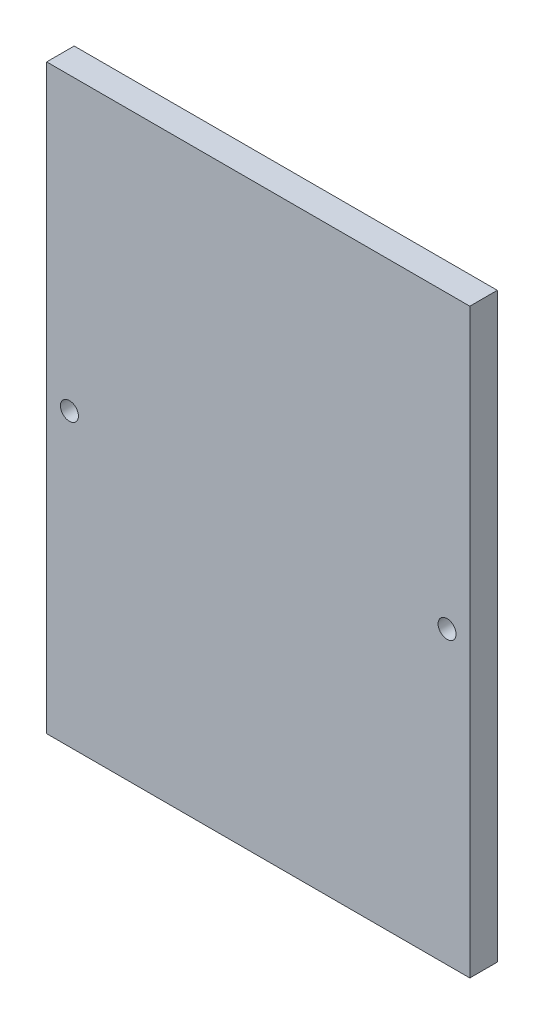
ISO-10303-21;
HEADER;
FILE_DESCRIPTION(('STEP AP214'),'2;1');
FILE_NAME('part.step','',(''),(''),'','','');
FILE_SCHEMA(('AUTOMOTIVE_DESIGN { 1 0 10303 214 1 1 1 1 }'));
ENDSEC;
DATA;
#1=APPLICATION_CONTEXT('core data for automotive mechanical design processes');
#2=APPLICATION_PROTOCOL_DEFINITION('international standard','automotive_design',2000,#1);
#3=PRODUCT_CONTEXT('',#1,'mechanical');
#4=PRODUCT('Part','Part','',(#3));
#5=PRODUCT_RELATED_PRODUCT_CATEGORY('part','',(#4));
#6=PRODUCT_DEFINITION_FORMATION('','',#4);
#7=PRODUCT_DEFINITION_CONTEXT('part definition',#1,'design');
#8=PRODUCT_DEFINITION('design','',#6,#7);
#9=PRODUCT_DEFINITION_SHAPE('','',#8);
#10=(LENGTH_UNIT() NAMED_UNIT(*) SI_UNIT(.MILLI.,.METRE.));
#11=(NAMED_UNIT(*) PLANE_ANGLE_UNIT() SI_UNIT($,.RADIAN.));
#12=(NAMED_UNIT(*) SI_UNIT($,.STERADIAN.) SOLID_ANGLE_UNIT());
#13=UNCERTAINTY_MEASURE_WITH_UNIT(LENGTH_MEASURE(1.E-05),#10,'distance_accuracy_value','');
#14=(GEOMETRIC_REPRESENTATION_CONTEXT(3) GLOBAL_UNCERTAINTY_ASSIGNED_CONTEXT((#13)) GLOBAL_UNIT_ASSIGNED_CONTEXT((#10,
#11,#12)) REPRESENTATION_CONTEXT('',''));
#15=CARTESIAN_POINT('',(0.,0.,0.));
#16=DIRECTION('',(0.,0.,1.));
#17=DIRECTION('',(1.,0.,0.));
#18=AXIS2_PLACEMENT_3D('',#15,#16,#17);
#19=CARTESIAN_POINT('',(-94.5483425414365,65.5084944751381,3.302));
#20=DIRECTION('',(1.,0.,0.));
#21=DIRECTION('',(0.,0.,-1.));
#22=AXIS2_PLACEMENT_3D('',#19,#20,#21);
#23=PLANE('',#22);
#24=DIRECTION('',(0.,-1.,0.));
#25=VECTOR('',#24,1.);
#26=CARTESIAN_POINT('',(-94.5483425414365,65.5084944751381,0.));
#27=LINE('',#26,#25);
#28=CARTESIAN_POINT('',(-94.5483425414365,65.5084944751381,0.));
#29=VERTEX_POINT('',#28);
#30=CARTESIAN_POINT('',(-94.5483425414365,-4.34150552486188,0.));
#31=VERTEX_POINT('',#30);
#32=EDGE_CURVE('E96',#29,#31,#27,.T.);
#33=ORIENTED_EDGE('',*,*,#32,.T.);
#34=DIRECTION('',(0.,0.,-1.));
#35=VECTOR('',#34,1.);
#36=CARTESIAN_POINT('',(-94.5483425414365,-4.34150552486188,3.302));
#37=LINE('',#36,#35);
#38=CARTESIAN_POINT('',(-94.5483425414365,-4.34150552486188,3.302));
#39=VERTEX_POINT('',#38);
#40=EDGE_CURVE('E11',#39,#31,#37,.T.);
#41=ORIENTED_EDGE('',*,*,#40,.F.);
#42=DIRECTION('',(0.,-1.,0.));
#43=VECTOR('',#42,1.);
#44=CARTESIAN_POINT('',(-94.5483425414365,65.5084944751381,3.302));
#45=LINE('',#44,#43);
#46=CARTESIAN_POINT('',(-94.5483425414365,65.5084944751381,3.302));
#47=VERTEX_POINT('',#46);
#48=EDGE_CURVE('E82',#47,#39,#45,.T.);
#49=ORIENTED_EDGE('',*,*,#48,.F.);
#50=DIRECTION('',(0.,0.,-1.));
#51=VECTOR('',#50,1.);
#52=CARTESIAN_POINT('',(-94.5483425414365,65.5084944751381,3.302));
#53=LINE('',#52,#51);
#54=EDGE_CURVE('E49',#47,#29,#53,.T.);
#55=ORIENTED_EDGE('',*,*,#54,.T.);
#56=EDGE_LOOP('',(#33,#41,#49,#55));
#57=FACE_BOUND('',#56,.T.);
#58=ADVANCED_FACE('F33',(#57),#23,.F.);
#59=CARTESIAN_POINT('',(-94.5483425414365,-4.34150552486188,3.302));
#60=DIRECTION('',(0.,1.,0.));
#61=DIRECTION('',(0.,0.,1.));
#62=AXIS2_PLACEMENT_3D('',#59,#60,#61);
#63=PLANE('',#62);
#64=DIRECTION('',(1.,0.,0.));
#65=VECTOR('',#64,1.);
#66=CARTESIAN_POINT('',(-94.5483425414365,-4.34150552486188,0.));
#67=LINE('',#66,#65);
#68=CARTESIAN_POINT('',(-43.7483425414365,-4.34150552486188,0.));
#69=VERTEX_POINT('',#68);
#70=EDGE_CURVE('E87',#31,#69,#67,.T.);
#71=ORIENTED_EDGE('',*,*,#70,.T.);
#72=DIRECTION('',(0.,0.,-1.));
#73=VECTOR('',#72,1.);
#74=CARTESIAN_POINT('',(-43.7483425414365,-4.34150552486188,3.302));
#75=LINE('',#74,#73);
#76=CARTESIAN_POINT('',(-43.7483425414365,-4.34150552486188,3.302));
#77=VERTEX_POINT('',#76);
#78=EDGE_CURVE('E41',#77,#69,#75,.T.);
#79=ORIENTED_EDGE('',*,*,#78,.F.);
#80=DIRECTION('',(1.,0.,0.));
#81=VECTOR('',#80,1.);
#82=CARTESIAN_POINT('',(-94.5483425414365,-4.34150552486188,3.302));
#83=LINE('',#82,#81);
#84=EDGE_CURVE('E74',#39,#77,#83,.T.);
#85=ORIENTED_EDGE('',*,*,#84,.F.);
#86=ORIENTED_EDGE('',*,*,#40,.T.);
#87=EDGE_LOOP('',(#71,#79,#85,#86));
#88=FACE_BOUND('',#87,.T.);
#89=ADVANCED_FACE('F86',(#88),#63,.F.);
#90=CARTESIAN_POINT('',(-43.7483425414365,65.5084944751381,3.302));
#91=DIRECTION('',(1.,0.,0.));
#92=DIRECTION('',(0.,1.,0.));
#93=AXIS2_PLACEMENT_3D('',#90,#91,#92);
#94=PLANE('',#93);
#95=DIRECTION('',(0.,-1.,0.));
#96=VECTOR('',#95,1.);
#97=CARTESIAN_POINT('',(-43.7483425414365,65.5084944751381,0.));
#98=LINE('',#97,#96);
#99=CARTESIAN_POINT('',(-43.7483425414365,65.5084944751381,0.));
#100=VERTEX_POINT('',#99);
#101=EDGE_CURVE('E100',#100,#69,#98,.T.);
#102=ORIENTED_EDGE('',*,*,#101,.F.);
#103=DIRECTION('',(0.,0.,-1.));
#104=VECTOR('',#103,1.);
#105=CARTESIAN_POINT('',(-43.7483425414365,65.5084944751381,3.302));
#106=LINE('',#105,#104);
#107=CARTESIAN_POINT('',(-43.7483425414365,65.5084944751381,3.302));
#108=VERTEX_POINT('',#107);
#109=EDGE_CURVE('E63',#108,#100,#106,.T.);
#110=ORIENTED_EDGE('',*,*,#109,.F.);
#111=DIRECTION('',(0.,-1.,0.));
#112=VECTOR('',#111,1.);
#113=CARTESIAN_POINT('',(-43.7483425414365,65.5084944751381,3.302));
#114=LINE('',#113,#112);
#115=EDGE_CURVE('E81',#108,#77,#114,.T.);
#116=ORIENTED_EDGE('',*,*,#115,.T.);
#117=ORIENTED_EDGE('',*,*,#78,.T.);
#118=EDGE_LOOP('',(#102,#110,#116,#117));
#119=FACE_BOUND('',#118,.T.);
#120=ADVANCED_FACE('F90',(#119),#94,.T.);
#121=CARTESIAN_POINT('',(-94.5483425414365,65.5084944751381,3.302));
#122=DIRECTION('',(0.,1.,0.));
#123=DIRECTION('',(-1.,0.,0.));
#124=AXIS2_PLACEMENT_3D('',#121,#122,#123);
#125=PLANE('',#124);
#126=DIRECTION('',(1.,0.,0.));
#127=VECTOR('',#126,1.);
#128=CARTESIAN_POINT('',(-94.5483425414365,65.5084944751381,0.));
#129=LINE('',#128,#127);
#130=EDGE_CURVE('E102',#29,#100,#129,.T.);
#131=ORIENTED_EDGE('',*,*,#130,.F.);
#132=ORIENTED_EDGE('',*,*,#54,.F.);
#133=DIRECTION('',(1.,0.,0.));
#134=VECTOR('',#133,1.);
#135=CARTESIAN_POINT('',(-94.5483425414365,65.5084944751381,3.302));
#136=LINE('',#135,#134);
#137=EDGE_CURVE('E91',#47,#108,#136,.T.);
#138=ORIENTED_EDGE('',*,*,#137,.T.);
#139=ORIENTED_EDGE('',*,*,#109,.T.);
#140=EDGE_LOOP('',(#131,#132,#138,#139));
#141=FACE_BOUND('',#140,.T.);
#142=ADVANCED_FACE('F132',(#141),#125,.T.);
#143=CARTESIAN_POINT('',(0.,0.,3.302));
#144=DIRECTION('',(0.,0.,1.));
#145=DIRECTION('',(1.,0.,0.));
#146=AXIS2_PLACEMENT_3D('',#143,#144,#145);
#147=PLANE('',#146);
#148=CARTESIAN_POINT('',(-91.8178425414365,30.5834944751381,3.302));
#149=DIRECTION('',(0.,0.,1.));
#150=DIRECTION('',(1.,0.,0.));
#151=AXIS2_PLACEMENT_3D('',#148,#149,#150);
#152=CIRCLE('',#151,1.0795);
#153=CARTESIAN_POINT('',(-90.7383425414365,30.5834944751381,3.302));
#154=VERTEX_POINT('',#153);
#155=EDGE_CURVE('E114',#154,#154,#152,.T.);
#156=ORIENTED_EDGE('',*,*,#155,.F.);
#157=EDGE_LOOP('',(#156));
#158=FACE_BOUND('',#157,.T.);
#159=CARTESIAN_POINT('',(-46.4788425414364,30.5834944751381,3.302));
#160=DIRECTION('',(0.,0.,1.));
#161=DIRECTION('',(1.,0.,0.));
#162=AXIS2_PLACEMENT_3D('',#159,#160,#161);
#163=CIRCLE('',#162,1.0795);
#164=CARTESIAN_POINT('',(-45.3993425414365,30.5834944751381,3.302));
#165=VERTEX_POINT('',#164);
#166=EDGE_CURVE('E108',#165,#165,#163,.T.);
#167=ORIENTED_EDGE('',*,*,#166,.F.);
#168=EDGE_LOOP('',(#167));
#169=FACE_BOUND('',#168,.T.);
#170=ORIENTED_EDGE('',*,*,#48,.T.);
#171=ORIENTED_EDGE('',*,*,#84,.T.);
#172=ORIENTED_EDGE('',*,*,#115,.F.);
#173=ORIENTED_EDGE('',*,*,#137,.F.);
#174=EDGE_LOOP('',(#170,#171,#172,#173));
#175=FACE_BOUND('',#174,.T.);
#176=ADVANCED_FACE('F78',(#158,#169,#175),#147,.T.);
#177=CARTESIAN_POINT('',(0.,0.,0.));
#178=DIRECTION('',(0.,0.,1.));
#179=DIRECTION('',(1.,0.,0.));
#180=AXIS2_PLACEMENT_3D('',#177,#178,#179);
#181=PLANE('',#180);
#182=CARTESIAN_POINT('',(-91.8178425414365,30.5834944751381,0.));
#183=DIRECTION('',(0.,0.,1.));
#184=DIRECTION('',(1.,0.,0.));
#185=AXIS2_PLACEMENT_3D('',#182,#183,#184);
#186=CIRCLE('',#185,1.0795);
#187=CARTESIAN_POINT('',(-90.7383425414365,30.5834944751381,0.));
#188=VERTEX_POINT('',#187);
#189=EDGE_CURVE('E111',#188,#188,#186,.T.);
#190=ORIENTED_EDGE('',*,*,#189,.T.);
#191=EDGE_LOOP('',(#190));
#192=FACE_BOUND('',#191,.T.);
#193=CARTESIAN_POINT('',(-46.4788425414364,30.5834944751381,0.));
#194=DIRECTION('',(0.,0.,1.));
#195=DIRECTION('',(1.,0.,0.));
#196=AXIS2_PLACEMENT_3D('',#193,#194,#195);
#197=CIRCLE('',#196,1.0795);
#198=CARTESIAN_POINT('',(-45.3993425414365,30.5834944751381,0.));
#199=VERTEX_POINT('',#198);
#200=EDGE_CURVE('E98',#199,#199,#197,.T.);
#201=ORIENTED_EDGE('',*,*,#200,.T.);
#202=EDGE_LOOP('',(#201));
#203=FACE_BOUND('',#202,.T.);
#204=ORIENTED_EDGE('',*,*,#32,.F.);
#205=ORIENTED_EDGE('',*,*,#130,.T.);
#206=ORIENTED_EDGE('',*,*,#101,.T.);
#207=ORIENTED_EDGE('',*,*,#70,.F.);
#208=EDGE_LOOP('',(#204,#205,#206,#207));
#209=FACE_BOUND('',#208,.T.);
#210=ADVANCED_FACE('F120',(#192,#203,#209),#181,.F.);
#211=CARTESIAN_POINT('',(-46.4788425414364,30.5834944751381,0.));
#212=DIRECTION('',(0.,0.,1.));
#213=DIRECTION('',(1.,0.,0.));
#214=AXIS2_PLACEMENT_3D('',#211,#212,#213);
#215=CYLINDRICAL_SURFACE('',#214,1.0795);
#216=ORIENTED_EDGE('',*,*,#200,.F.);
#217=EDGE_LOOP('',(#216));
#218=FACE_BOUND('',#217,.T.);
#219=ORIENTED_EDGE('',*,*,#166,.T.);
#220=EDGE_LOOP('',(#219));
#221=FACE_BOUND('',#220,.T.);
#222=ADVANCED_FACE('F126',(#218,#221),#215,.F.);
#223=CARTESIAN_POINT('',(-91.8178425414365,30.5834944751381,0.));
#224=DIRECTION('',(0.,0.,1.));
#225=DIRECTION('',(1.,0.,0.));
#226=AXIS2_PLACEMENT_3D('',#223,#224,#225);
#227=CYLINDRICAL_SURFACE('',#226,1.0795);
#228=ORIENTED_EDGE('',*,*,#189,.F.);
#229=EDGE_LOOP('',(#228));
#230=FACE_BOUND('',#229,.T.);
#231=ORIENTED_EDGE('',*,*,#155,.T.);
#232=EDGE_LOOP('',(#231));
#233=FACE_BOUND('',#232,.T.);
#234=ADVANCED_FACE('F123',(#230,#233),#227,.F.);
#235=CLOSED_SHELL('',(#58,#89,#120,#142,#176,#210,#222,#234));
#236=MANIFOLD_SOLID_BREP('B2',#235);
#237=ADVANCED_BREP_SHAPE_REPRESENTATION('',(#18,#236),#14);
#238=SHAPE_DEFINITION_REPRESENTATION(#9,#237);
ENDSEC;
END-ISO-10303-21;
